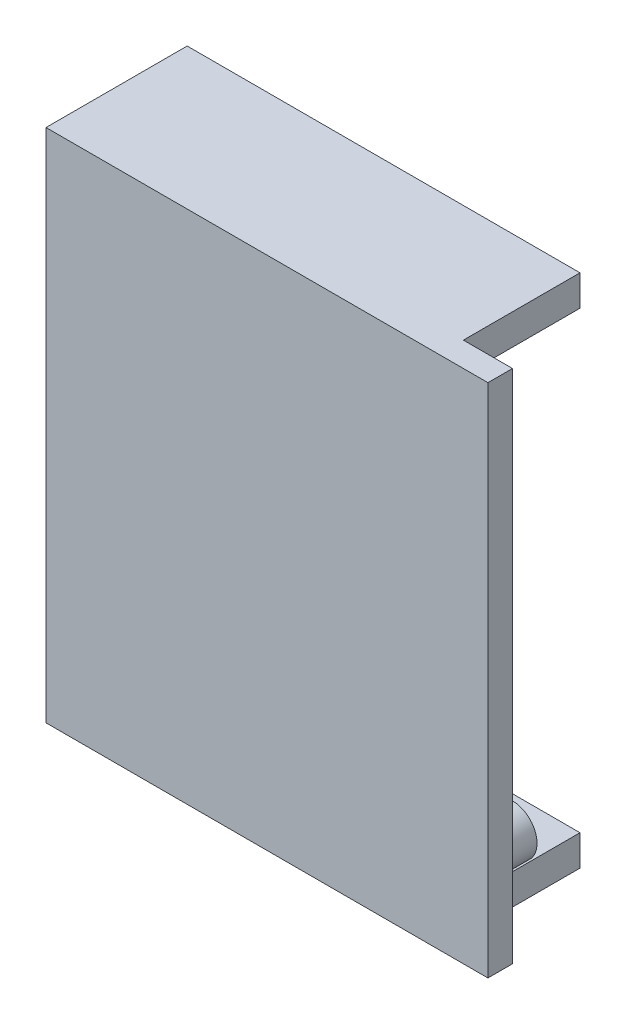
ISO-10303-21;
HEADER;
FILE_DESCRIPTION(('STEP AP214'),'2;1');
FILE_NAME('part.step','',(''),(''),'','','');
FILE_SCHEMA(('AUTOMOTIVE_DESIGN { 1 0 10303 214 1 1 1 1 }'));
ENDSEC;
DATA;
#1=APPLICATION_CONTEXT('core data for automotive mechanical design processes');
#2=APPLICATION_PROTOCOL_DEFINITION('international standard','automotive_design',2000,#1);
#3=PRODUCT_CONTEXT('',#1,'mechanical');
#4=PRODUCT('Part','Part','',(#3));
#5=PRODUCT_RELATED_PRODUCT_CATEGORY('part','',(#4));
#6=PRODUCT_DEFINITION_FORMATION('','',#4);
#7=PRODUCT_DEFINITION_CONTEXT('part definition',#1,'design');
#8=PRODUCT_DEFINITION('design','',#6,#7);
#9=PRODUCT_DEFINITION_SHAPE('','',#8);
#10=(LENGTH_UNIT() NAMED_UNIT(*) SI_UNIT(.MILLI.,.METRE.));
#11=(NAMED_UNIT(*) PLANE_ANGLE_UNIT() SI_UNIT($,.RADIAN.));
#12=(NAMED_UNIT(*) SI_UNIT($,.STERADIAN.) SOLID_ANGLE_UNIT());
#13=UNCERTAINTY_MEASURE_WITH_UNIT(LENGTH_MEASURE(1.E-05),#10,'distance_accuracy_value','');
#14=(GEOMETRIC_REPRESENTATION_CONTEXT(3) GLOBAL_UNCERTAINTY_ASSIGNED_CONTEXT((#13)) GLOBAL_UNIT_ASSIGNED_CONTEXT((#10,
#11,#12)) REPRESENTATION_CONTEXT('',''));
#15=CARTESIAN_POINT('',(0.,0.,0.));
#16=DIRECTION('',(0.,0.,1.));
#17=DIRECTION('',(1.,0.,0.));
#18=AXIS2_PLACEMENT_3D('',#15,#16,#17);
#19=CARTESIAN_POINT('',(-21.,18.5,-9.5));
#20=DIRECTION('',(0.,1.,0.));
#21=DIRECTION('',(-1.,0.,0.));
#22=AXIS2_PLACEMENT_3D('',#19,#20,#21);
#23=PLANE('',#22);
#24=DIRECTION('',(0.,0.,-1.));
#25=VECTOR('',#24,1.);
#26=CARTESIAN_POINT('',(-17.,18.5,-9.5));
#27=LINE('',#26,#25);
#28=CARTESIAN_POINT('',(-17.,18.5,0.));
#29=VERTEX_POINT('',#28);
#30=CARTESIAN_POINT('',(-17.,18.5,-9.5));
#31=VERTEX_POINT('',#30);
#32=EDGE_CURVE('E221',#29,#31,#27,.T.);
#33=ORIENTED_EDGE('',*,*,#32,.T.);
#34=DIRECTION('',(-1.,0.,0.));
#35=VECTOR('',#34,1.);
#36=CARTESIAN_POINT('',(-21.,18.5,-9.5));
#37=LINE('',#36,#35);
#38=CARTESIAN_POINT('',(11.,18.5,-9.5));
#39=VERTEX_POINT('',#38);
#40=EDGE_CURVE('E233',#39,#31,#37,.T.);
#41=ORIENTED_EDGE('',*,*,#40,.F.);
#42=DIRECTION('',(0.,0.,1.));
#43=VECTOR('',#42,1.);
#44=CARTESIAN_POINT('',(11.,18.5,-9.5));
#45=LINE('',#44,#43);
#46=CARTESIAN_POINT('',(11.,18.5,0.));
#47=VERTEX_POINT('',#46);
#48=EDGE_CURVE('E394',#39,#47,#45,.T.);
#49=ORIENTED_EDGE('',*,*,#48,.T.);
#50=DIRECTION('',(-1.,0.,0.));
#51=VECTOR('',#50,1.);
#52=CARTESIAN_POINT('',(-21.,18.5,0.));
#53=LINE('',#52,#51);
#54=CARTESIAN_POINT('',(-8.99999999999999,18.5,0.));
#55=VERTEX_POINT('',#54);
#56=EDGE_CURVE('E389',#47,#55,#53,.T.);
#57=ORIENTED_EDGE('',*,*,#56,.T.);
#58=DIRECTION('',(0.,0.,1.));
#59=VECTOR('',#58,1.);
#60=CARTESIAN_POINT('',(-8.99999999999999,18.5,-9.));
#61=LINE('',#60,#59);
#62=CARTESIAN_POINT('',(-8.99999999999999,18.5,-4.));
#63=VERTEX_POINT('',#62);
#64=EDGE_CURVE('E288',#63,#55,#61,.T.);
#65=ORIENTED_EDGE('',*,*,#64,.F.);
#66=DIRECTION('',(1.,0.,0.));
#67=VECTOR('',#66,1.);
#68=CARTESIAN_POINT('',(-8.99999999999999,18.5,-4.));
#69=LINE('',#68,#67);
#70=CARTESIAN_POINT('',(-13.,18.5,-4.));
#71=VERTEX_POINT('',#70);
#72=EDGE_CURVE('E293',#71,#63,#69,.T.);
#73=ORIENTED_EDGE('',*,*,#72,.F.);
#74=DIRECTION('',(0.,0.,1.));
#75=VECTOR('',#74,1.);
#76=CARTESIAN_POINT('',(-13.,18.5,-9.));
#77=LINE('',#76,#75);
#78=CARTESIAN_POINT('',(-13.,18.5,0.));
#79=VERTEX_POINT('',#78);
#80=EDGE_CURVE('E291',#71,#79,#77,.T.);
#81=ORIENTED_EDGE('',*,*,#80,.T.);
#82=EDGE_CURVE('E397',#79,#29,#53,.T.);
#83=ORIENTED_EDGE('',*,*,#82,.T.);
#84=EDGE_LOOP('',(#33,#41,#49,#57,#65,#73,#81,#83));
#85=FACE_BOUND('',#84,.T.);
#86=ADVANCED_FACE('F35',(#85),#23,.F.);
#87=CARTESIAN_POINT('',(0.,0.,0.));
#88=DIRECTION('',(0.,0.,-1.));
#89=DIRECTION('',(-1.,0.,0.));
#90=AXIS2_PLACEMENT_3D('',#87,#88,#89);
#91=PLANE('',#90);
#92=DIRECTION('',(-1.,0.,0.));
#93=VECTOR('',#92,1.);
#94=CARTESIAN_POINT('',(-17.,17.,0.));
#95=LINE('',#94,#93);
#96=CARTESIAN_POINT('',(-17.,17.,0.));
#97=VERTEX_POINT('',#96);
#98=CARTESIAN_POINT('',(-21.,17.,0.));
#99=VERTEX_POINT('',#98);
#100=EDGE_CURVE('E220',#97,#99,#95,.T.);
#101=ORIENTED_EDGE('',*,*,#100,.F.);
#102=DIRECTION('',(0.,1.,0.));
#103=VECTOR('',#102,1.);
#104=CARTESIAN_POINT('',(-17.,18.5,0.));
#105=LINE('',#104,#103);
#106=EDGE_CURVE('E228',#97,#29,#105,.T.);
#107=ORIENTED_EDGE('',*,*,#106,.T.);
#108=ORIENTED_EDGE('',*,*,#82,.F.);
#109=DIRECTION('',(0.,1.,0.));
#110=VECTOR('',#109,1.);
#111=CARTESIAN_POINT('',(-13.,18.5,0.));
#112=LINE('',#111,#110);
#113=CARTESIAN_POINT('',(-13.,15.5,0.));
#114=VERTEX_POINT('',#113);
#115=EDGE_CURVE('E289',#114,#79,#112,.T.);
#116=ORIENTED_EDGE('',*,*,#115,.F.);
#117=CARTESIAN_POINT('',(-11.,15.5,0.));
#118=DIRECTION('',(0.,0.,-1.));
#119=DIRECTION('',(-1.,0.,0.));
#120=AXIS2_PLACEMENT_3D('',#117,#118,#119);
#121=CIRCLE('',#120,2.);
#122=CARTESIAN_POINT('',(-8.99999999999999,15.5,0.));
#123=VERTEX_POINT('',#122);
#124=EDGE_CURVE('E328',#123,#114,#121,.T.);
#125=ORIENTED_EDGE('',*,*,#124,.F.);
#126=DIRECTION('',(0.,-1.,0.));
#127=VECTOR('',#126,1.);
#128=CARTESIAN_POINT('',(-8.99999999999999,15.5,0.));
#129=LINE('',#128,#127);
#130=EDGE_CURVE('E285',#55,#123,#129,.T.);
#131=ORIENTED_EDGE('',*,*,#130,.F.);
#132=ORIENTED_EDGE('',*,*,#56,.F.);
#133=DIRECTION('',(0.,1.,0.));
#134=VECTOR('',#133,1.);
#135=CARTESIAN_POINT('',(11.,19.75,0.));
#136=LINE('',#135,#134);
#137=CARTESIAN_POINT('',(11.,-13.5,0.));
#138=VERTEX_POINT('',#137);
#139=EDGE_CURVE('E354',#138,#47,#136,.T.);
#140=ORIENTED_EDGE('',*,*,#139,.F.);
#141=CARTESIAN_POINT('',(11.,-15.5,0.));
#142=DIRECTION('',(0.,0.,-1.));
#143=DIRECTION('',(-1.,0.,0.));
#144=AXIS2_PLACEMENT_3D('',#141,#142,#143);
#145=CIRCLE('',#144,2.);
#146=CARTESIAN_POINT('',(9.00000000000001,-15.5,0.));
#147=VERTEX_POINT('',#146);
#148=EDGE_CURVE('E319',#147,#138,#145,.T.);
#149=ORIENTED_EDGE('',*,*,#148,.F.);
#150=DIRECTION('',(0.,1.,0.));
#151=VECTOR('',#150,1.);
#152=CARTESIAN_POINT('',(9.00000000000001,-15.5,0.));
#153=LINE('',#152,#151);
#154=CARTESIAN_POINT('',(9.00000000000001,-18.5,0.));
#155=VERTEX_POINT('',#154);
#156=EDGE_CURVE('E272',#155,#147,#153,.T.);
#157=ORIENTED_EDGE('',*,*,#156,.F.);
#158=DIRECTION('',(1.,0.,0.));
#159=VECTOR('',#158,1.);
#160=CARTESIAN_POINT('',(-21.,-18.5,0.));
#161=LINE('',#160,#159);
#162=CARTESIAN_POINT('',(-17.,-18.5,0.));
#163=VERTEX_POINT('',#162);
#164=EDGE_CURVE('E360',#163,#155,#161,.T.);
#165=ORIENTED_EDGE('',*,*,#164,.F.);
#166=DIRECTION('',(0.,1.,0.));
#167=VECTOR('',#166,1.);
#168=CARTESIAN_POINT('',(-17.,-18.5,0.));
#169=LINE('',#168,#167);
#170=CARTESIAN_POINT('',(-17.,-17.,0.));
#171=VERTEX_POINT('',#170);
#172=EDGE_CURVE('E245',#163,#171,#169,.T.);
#173=ORIENTED_EDGE('',*,*,#172,.T.);
#174=DIRECTION('',(-1.,0.,0.));
#175=VECTOR('',#174,1.);
#176=CARTESIAN_POINT('',(-17.,-17.,0.));
#177=LINE('',#176,#175);
#178=CARTESIAN_POINT('',(-21.,-17.,0.));
#179=VERTEX_POINT('',#178);
#180=EDGE_CURVE('E251',#171,#179,#177,.T.);
#181=ORIENTED_EDGE('',*,*,#180,.T.);
#182=DIRECTION('',(0.,-1.,0.));
#183=VECTOR('',#182,1.);
#184=CARTESIAN_POINT('',(-21.,-21.,0.));
#185=LINE('',#184,#183);
#186=EDGE_CURVE('E405',#99,#179,#185,.T.);
#187=ORIENTED_EDGE('',*,*,#186,.F.);
#188=EDGE_LOOP('',(#101,#107,#108,#116,#125,#131,#132,#140,#149,#157,#165,#173,#181,#187));
#189=FACE_BOUND('',#188,.T.);
#190=CARTESIAN_POINT('',(7.5,12.5,0.));
#191=DIRECTION('',(0.,0.,-1.));
#192=DIRECTION('',(-1.,0.,0.));
#193=AXIS2_PLACEMENT_3D('',#190,#191,#192);
#194=CIRCLE('',#193,2.5);
#195=CARTESIAN_POINT('',(5.,12.5,0.));
#196=VERTEX_POINT('',#195);
#197=EDGE_CURVE('E257',#196,#196,#194,.T.);
#198=ORIENTED_EDGE('',*,*,#197,.F.);
#199=EDGE_LOOP('',(#198));
#200=FACE_BOUND('',#199,.T.);
#201=CARTESIAN_POINT('',(-7.5,-12.5,0.));
#202=DIRECTION('',(0.,0.,-1.));
#203=DIRECTION('',(-1.,0.,0.));
#204=AXIS2_PLACEMENT_3D('',#201,#202,#203);
#205=CIRCLE('',#204,2.5);
#206=CARTESIAN_POINT('',(-10.,-12.5,0.));
#207=VERTEX_POINT('',#206);
#208=EDGE_CURVE('E263',#207,#207,#205,.T.);
#209=ORIENTED_EDGE('',*,*,#208,.F.);
#210=EDGE_LOOP('',(#209));
#211=FACE_BOUND('',#210,.T.);
#212=ADVANCED_FACE('F447',(#189,#200,#211),#91,.T.);
#213=CARTESIAN_POINT('',(-21.,-18.5,-9.5));
#214=DIRECTION('',(0.,-1.,0.));
#215=DIRECTION('',(1.,0.,0.));
#216=AXIS2_PLACEMENT_3D('',#213,#214,#215);
#217=PLANE('',#216);
#218=DIRECTION('',(1.,0.,0.));
#219=VECTOR('',#218,1.);
#220=CARTESIAN_POINT('',(-21.,-18.5,-9.5));
#221=LINE('',#220,#219);
#222=CARTESIAN_POINT('',(-17.,-18.5,-9.5));
#223=VERTEX_POINT('',#222);
#224=CARTESIAN_POINT('',(11.,-18.5,-9.5));
#225=VERTEX_POINT('',#224);
#226=EDGE_CURVE('E369',#223,#225,#221,.T.);
#227=ORIENTED_EDGE('',*,*,#226,.F.);
#228=DIRECTION('',(0.,0.,1.));
#229=VECTOR('',#228,1.);
#230=CARTESIAN_POINT('',(-17.,-18.5,-9.5));
#231=LINE('',#230,#229);
#232=EDGE_CURVE('E242',#223,#163,#231,.T.);
#233=ORIENTED_EDGE('',*,*,#232,.T.);
#234=ORIENTED_EDGE('',*,*,#164,.T.);
#235=DIRECTION('',(0.,0.,1.));
#236=VECTOR('',#235,1.);
#237=CARTESIAN_POINT('',(9.00000000000001,-18.5,-7.605551275464));
#238=LINE('',#237,#236);
#239=CARTESIAN_POINT('',(9.00000000000001,-18.5,-4.));
#240=VERTEX_POINT('',#239);
#241=EDGE_CURVE('E274',#240,#155,#238,.T.);
#242=ORIENTED_EDGE('',*,*,#241,.F.);
#243=DIRECTION('',(-1.,0.,0.));
#244=VECTOR('',#243,1.);
#245=CARTESIAN_POINT('',(9.00000000000001,-18.5,-4.));
#246=LINE('',#245,#244);
#247=CARTESIAN_POINT('',(11.,-18.5,-4.));
#248=VERTEX_POINT('',#247);
#249=EDGE_CURVE('E275',#248,#240,#246,.T.);
#250=ORIENTED_EDGE('',*,*,#249,.F.);
#251=DIRECTION('',(0.,0.,1.));
#252=VECTOR('',#251,1.);
#253=CARTESIAN_POINT('',(11.,-18.5,-9.5));
#254=LINE('',#253,#252);
#255=EDGE_CURVE('E382',#225,#248,#254,.T.);
#256=ORIENTED_EDGE('',*,*,#255,.F.);
#257=EDGE_LOOP('',(#227,#233,#234,#242,#250,#256));
#258=FACE_BOUND('',#257,.T.);
#259=ADVANCED_FACE('F455',(#258),#217,.F.);
#260=CARTESIAN_POINT('',(11.,-15.5,-4.));
#261=DIRECTION('',(0.,0.,1.));
#262=DIRECTION('',(1.,0.,0.));
#263=AXIS2_PLACEMENT_3D('',#260,#261,#262);
#264=CYLINDRICAL_SURFACE('',#263,2.);
#265=DIRECTION('',(0.,0.,-1.));
#266=VECTOR('',#265,1.);
#267=CARTESIAN_POINT('',(11.,-17.5,6.65685424949238));
#268=LINE('',#267,#266);
#269=CARTESIAN_POINT('',(11.,-17.5,-4.));
#270=VERTEX_POINT('',#269);
#271=CARTESIAN_POINT('',(11.,-17.5,1.));
#272=VERTEX_POINT('',#271);
#273=EDGE_CURVE('E309',#270,#272,#268,.F.);
#274=ORIENTED_EDGE('',*,*,#273,.F.);
#275=CARTESIAN_POINT('',(11.,-15.5,-4.));
#276=DIRECTION('',(0.,0.,-1.));
#277=DIRECTION('',(-1.,0.,0.));
#278=AXIS2_PLACEMENT_3D('',#275,#276,#277);
#279=CIRCLE('',#278,2.);
#280=CARTESIAN_POINT('',(9.00000000000001,-15.5,-4.));
#281=VERTEX_POINT('',#280);
#282=EDGE_CURVE('E322',#281,#270,#279,.T.);
#283=ORIENTED_EDGE('',*,*,#282,.F.);
#284=DIRECTION('',(0.,0.,1.));
#285=VECTOR('',#284,1.);
#286=CARTESIAN_POINT('',(9.00000000000001,-15.5,-7.605551275464));
#287=LINE('',#286,#285);
#288=EDGE_CURVE('E269',#281,#147,#287,.T.);
#289=ORIENTED_EDGE('',*,*,#288,.T.);
#290=ORIENTED_EDGE('',*,*,#148,.T.);
#291=DIRECTION('',(0.,0.,-1.));
#292=VECTOR('',#291,1.);
#293=CARTESIAN_POINT('',(11.,-13.5,6.65685424949238));
#294=LINE('',#293,#292);
#295=CARTESIAN_POINT('',(11.,-13.5,1.));
#296=VERTEX_POINT('',#295);
#297=EDGE_CURVE('E312',#296,#138,#294,.T.);
#298=ORIENTED_EDGE('',*,*,#297,.F.);
#299=CARTESIAN_POINT('',(11.,-15.5,1.));
#300=DIRECTION('',(0.,0.,-1.));
#301=DIRECTION('',(-1.,0.,0.));
#302=AXIS2_PLACEMENT_3D('',#299,#300,#301);
#303=CIRCLE('',#302,2.);
#304=EDGE_CURVE('E296',#272,#296,#303,.F.);
#305=ORIENTED_EDGE('',*,*,#304,.F.);
#306=EDGE_LOOP('',(#274,#283,#289,#290,#298,#305));
#307=FACE_BOUND('',#306,.T.);
#308=ADVANCED_FACE('F695',(#307),#264,.T.);
#309=CARTESIAN_POINT('',(-11.,15.5,-4.));
#310=DIRECTION('',(0.,0.,1.));
#311=DIRECTION('',(1.,0.,0.));
#312=AXIS2_PLACEMENT_3D('',#309,#310,#311);
#313=CYLINDRICAL_SURFACE('',#312,2.);
#314=DIRECTION('',(0.,0.,1.));
#315=VECTOR('',#314,1.);
#316=CARTESIAN_POINT('',(-13.,15.5,-9.));
#317=LINE('',#316,#315);
#318=CARTESIAN_POINT('',(-13.,15.5,-4.));
#319=VERTEX_POINT('',#318);
#320=EDGE_CURVE('E292',#319,#114,#317,.T.);
#321=ORIENTED_EDGE('',*,*,#320,.F.);
#322=CARTESIAN_POINT('',(-11.,15.5,-4.));
#323=DIRECTION('',(0.,0.,-1.));
#324=DIRECTION('',(-1.,0.,0.));
#325=AXIS2_PLACEMENT_3D('',#322,#323,#324);
#326=CIRCLE('',#325,2.);
#327=CARTESIAN_POINT('',(-8.99999999999999,15.5,-4.));
#328=VERTEX_POINT('',#327);
#329=EDGE_CURVE('E329',#328,#319,#326,.T.);
#330=ORIENTED_EDGE('',*,*,#329,.F.);
#331=DIRECTION('',(0.,0.,1.));
#332=VECTOR('',#331,1.);
#333=CARTESIAN_POINT('',(-8.99999999999999,15.5,-9.));
#334=LINE('',#333,#332);
#335=EDGE_CURVE('E277',#328,#123,#334,.T.);
#336=ORIENTED_EDGE('',*,*,#335,.T.);
#337=ORIENTED_EDGE('',*,*,#124,.T.);
#338=EDGE_LOOP('',(#321,#330,#336,#337));
#339=FACE_BOUND('',#338,.T.);
#340=ADVANCED_FACE('F498',(#339),#313,.T.);
#341=CARTESIAN_POINT('',(11.,21.,-9.5));
#342=DIRECTION('',(-1.,0.,0.));
#343=DIRECTION('',(0.,0.,1.));
#344=AXIS2_PLACEMENT_3D('',#341,#342,#343);
#345=PLANE('',#344);
#346=DIRECTION('',(0.,1.,0.));
#347=VECTOR('',#346,1.);
#348=CARTESIAN_POINT('',(11.,19.75,1.));
#349=LINE('',#348,#347);
#350=CARTESIAN_POINT('',(11.,19.75,1.));
#351=VERTEX_POINT('',#350);
#352=EDGE_CURVE('E342',#296,#351,#349,.T.);
#353=ORIENTED_EDGE('',*,*,#352,.F.);
#354=ORIENTED_EDGE('',*,*,#297,.T.);
#355=ORIENTED_EDGE('',*,*,#139,.T.);
#356=ORIENTED_EDGE('',*,*,#48,.F.);
#357=DIRECTION('',(0.,-1.,0.));
#358=VECTOR('',#357,1.);
#359=CARTESIAN_POINT('',(11.,21.,-9.5));
#360=LINE('',#359,#358);
#361=CARTESIAN_POINT('',(11.,21.,-9.5));
#362=VERTEX_POINT('',#361);
#363=EDGE_CURVE('E391',#362,#39,#360,.T.);
#364=ORIENTED_EDGE('',*,*,#363,.F.);
#365=DIRECTION('',(0.,0.,1.));
#366=VECTOR('',#365,1.);
#367=CARTESIAN_POINT('',(11.,21.,-9.5));
#368=LINE('',#367,#366);
#369=CARTESIAN_POINT('',(11.,21.,0.));
#370=VERTEX_POINT('',#369);
#371=EDGE_CURVE('E402',#362,#370,#368,.T.);
#372=ORIENTED_EDGE('',*,*,#371,.T.);
#373=DIRECTION('',(0.,-1.,0.));
#374=VECTOR('',#373,1.);
#375=CARTESIAN_POINT('',(11.,21.,0.));
#376=LINE('',#375,#374);
#377=CARTESIAN_POINT('',(11.,19.75,0.));
#378=VERTEX_POINT('',#377);
#379=EDGE_CURVE('E385',#370,#378,#376,.T.);
#380=ORIENTED_EDGE('',*,*,#379,.T.);
#381=DIRECTION('',(0.,0.,-1.));
#382=VECTOR('',#381,1.);
#383=CARTESIAN_POINT('',(11.,19.75,1.));
#384=LINE('',#383,#382);
#385=EDGE_CURVE('E361',#351,#378,#384,.T.);
#386=ORIENTED_EDGE('',*,*,#385,.F.);
#387=EDGE_LOOP('',(#353,#354,#355,#356,#364,#372,#380,#386));
#388=FACE_BOUND('',#387,.T.);
#389=ADVANCED_FACE('F486',(#388),#345,.F.);
#390=CARTESIAN_POINT('',(11.,-15.5,0.));
#391=DIRECTION('',(0.,0.,-1.));
#392=DIRECTION('',(-1.,0.,0.));
#393=AXIS2_PLACEMENT_3D('',#390,#391,#392);
#394=CIRCLE('',#393,1.1);
#395=CARTESIAN_POINT('',(9.90000000000001,-15.5,0.));
#396=VERTEX_POINT('',#395);
#397=EDGE_CURVE('E315',#396,#396,#394,.T.);
#398=ORIENTED_EDGE('',*,*,#397,.T.);
#399=EDGE_LOOP('',(#398));
#400=FACE_BOUND('',#399,.T.);
#401=ADVANCED_FACE('F528',(#400),#91,.T.);
#402=DIRECTION('',(1.,0.,0.));
#403=VECTOR('',#402,1.);
#404=CARTESIAN_POINT('',(14.,19.75,0.));
#405=LINE('',#404,#403);
#406=CARTESIAN_POINT('',(14.,19.75,0.));
#407=VERTEX_POINT('',#406);
#408=EDGE_CURVE('E339',#378,#407,#405,.T.);
#409=ORIENTED_EDGE('',*,*,#408,.F.);
#410=ORIENTED_EDGE('',*,*,#379,.F.);
#411=DIRECTION('',(-1.,0.,0.));
#412=VECTOR('',#411,1.);
#413=CARTESIAN_POINT('',(-21.,21.,0.));
#414=LINE('',#413,#412);
#415=CARTESIAN_POINT('',(15.,21.,0.));
#416=VERTEX_POINT('',#415);
#417=EDGE_CURVE('E410',#416,#370,#414,.T.);
#418=ORIENTED_EDGE('',*,*,#417,.F.);
#419=DIRECTION('',(0.,1.,0.));
#420=VECTOR('',#419,1.);
#421=CARTESIAN_POINT('',(15.,-21.,0.));
#422=LINE('',#421,#420);
#423=CARTESIAN_POINT('',(15.,-21.,0.));
#424=VERTEX_POINT('',#423);
#425=EDGE_CURVE('E420',#424,#416,#422,.T.);
#426=ORIENTED_EDGE('',*,*,#425,.F.);
#427=DIRECTION('',(1.,0.,0.));
#428=VECTOR('',#427,1.);
#429=CARTESIAN_POINT('',(-21.,-21.,0.));
#430=LINE('',#429,#428);
#431=CARTESIAN_POINT('',(11.,-21.,0.));
#432=VERTEX_POINT('',#431);
#433=EDGE_CURVE('E418',#432,#424,#430,.T.);
#434=ORIENTED_EDGE('',*,*,#433,.F.);
#435=DIRECTION('',(0.,-1.,0.));
#436=VECTOR('',#435,1.);
#437=CARTESIAN_POINT('',(11.,-21.,0.));
#438=LINE('',#437,#436);
#439=CARTESIAN_POINT('',(11.,-19.75,0.));
#440=VERTEX_POINT('',#439);
#441=EDGE_CURVE('E370',#440,#432,#438,.T.);
#442=ORIENTED_EDGE('',*,*,#441,.F.);
#443=DIRECTION('',(-1.,0.,0.));
#444=VECTOR('',#443,1.);
#445=CARTESIAN_POINT('',(14.,-19.75,0.));
#446=LINE('',#445,#444);
#447=CARTESIAN_POINT('',(14.,-19.75,0.));
#448=VERTEX_POINT('',#447);
#449=EDGE_CURVE('E352',#448,#440,#446,.T.);
#450=ORIENTED_EDGE('',*,*,#449,.F.);
#451=DIRECTION('',(0.,-1.,0.));
#452=VECTOR('',#451,1.);
#453=CARTESIAN_POINT('',(14.,19.75,0.));
#454=LINE('',#453,#452);
#455=EDGE_CURVE('E332',#407,#448,#454,.T.);
#456=ORIENTED_EDGE('',*,*,#455,.F.);
#457=EDGE_LOOP('',(#409,#410,#418,#426,#434,#442,#450,#456));
#458=FACE_BOUND('',#457,.T.);
#459=ADVANCED_FACE('F467',(#458),#91,.T.);
#460=CARTESIAN_POINT('',(-21.,-21.,2.));
#461=DIRECTION('',(1.,0.,0.));
#462=DIRECTION('',(0.,0.,-1.));
#463=AXIS2_PLACEMENT_3D('',#460,#461,#462);
#464=PLANE('',#463);
#465=DIRECTION('',(0.,1.,0.));
#466=VECTOR('',#465,1.);
#467=CARTESIAN_POINT('',(-21.,21.,-9.5));
#468=LINE('',#467,#466);
#469=CARTESIAN_POINT('',(-21.,17.,-9.5));
#470=VERTEX_POINT('',#469);
#471=CARTESIAN_POINT('',(-21.,21.,-9.5));
#472=VERTEX_POINT('',#471);
#473=EDGE_CURVE('E386',#470,#472,#468,.T.);
#474=ORIENTED_EDGE('',*,*,#473,.F.);
#475=DIRECTION('',(0.,0.,1.));
#476=VECTOR('',#475,1.);
#477=CARTESIAN_POINT('',(-21.,17.,-9.5));
#478=LINE('',#477,#476);
#479=EDGE_CURVE('E216',#470,#99,#478,.T.);
#480=ORIENTED_EDGE('',*,*,#479,.T.);
#481=ORIENTED_EDGE('',*,*,#186,.T.);
#482=DIRECTION('',(0.,0.,-1.));
#483=VECTOR('',#482,1.);
#484=CARTESIAN_POINT('',(-21.,-17.,-9.5));
#485=LINE('',#484,#483);
#486=CARTESIAN_POINT('',(-21.,-17.,-9.5));
#487=VERTEX_POINT('',#486);
#488=EDGE_CURVE('E239',#179,#487,#485,.T.);
#489=ORIENTED_EDGE('',*,*,#488,.T.);
#490=DIRECTION('',(0.,1.,0.));
#491=VECTOR('',#490,1.);
#492=CARTESIAN_POINT('',(-21.,-21.,-9.5));
#493=LINE('',#492,#491);
#494=CARTESIAN_POINT('',(-21.,-21.,-9.5));
#495=VERTEX_POINT('',#494);
#496=EDGE_CURVE('E367',#495,#487,#493,.T.);
#497=ORIENTED_EDGE('',*,*,#496,.F.);
#498=DIRECTION('',(0.,0.,-1.));
#499=VECTOR('',#498,1.);
#500=CARTESIAN_POINT('',(-21.,-21.,2.));
#501=LINE('',#500,#499);
#502=CARTESIAN_POINT('',(-21.,-21.,2.));
#503=VERTEX_POINT('',#502);
#504=EDGE_CURVE('E43',#503,#495,#501,.T.);
#505=ORIENTED_EDGE('',*,*,#504,.F.);
#506=DIRECTION('',(0.,-1.,0.));
#507=VECTOR('',#506,1.);
#508=CARTESIAN_POINT('',(-21.,-21.,2.));
#509=LINE('',#508,#507);
#510=CARTESIAN_POINT('',(-21.,21.,2.));
#511=VERTEX_POINT('',#510);
#512=EDGE_CURVE('E406',#511,#503,#509,.T.);
#513=ORIENTED_EDGE('',*,*,#512,.F.);
#514=DIRECTION('',(0.,0.,-1.));
#515=VECTOR('',#514,1.);
#516=CARTESIAN_POINT('',(-21.,21.,2.));
#517=LINE('',#516,#515);
#518=EDGE_CURVE('E416',#511,#472,#517,.T.);
#519=ORIENTED_EDGE('',*,*,#518,.T.);
#520=EDGE_LOOP('',(#474,#480,#481,#489,#497,#505,#513,#519));
#521=FACE_BOUND('',#520,.T.);
#522=ADVANCED_FACE('F37',(#521),#464,.F.);
#523=CARTESIAN_POINT('',(-21.,-21.,2.));
#524=DIRECTION('',(0.,1.,0.));
#525=DIRECTION('',(0.,0.,1.));
#526=AXIS2_PLACEMENT_3D('',#523,#524,#525);
#527=PLANE('',#526);
#528=ORIENTED_EDGE('',*,*,#504,.T.);
#529=DIRECTION('',(-1.,0.,0.));
#530=VECTOR('',#529,1.);
#531=CARTESIAN_POINT('',(-21.,-21.,-9.5));
#532=LINE('',#531,#530);
#533=CARTESIAN_POINT('',(11.,-21.,-9.5));
#534=VERTEX_POINT('',#533);
#535=EDGE_CURVE('E374',#534,#495,#532,.T.);
#536=ORIENTED_EDGE('',*,*,#535,.F.);
#537=DIRECTION('',(0.,0.,1.));
#538=VECTOR('',#537,1.);
#539=CARTESIAN_POINT('',(11.,-21.,-9.5));
#540=LINE('',#539,#538);
#541=EDGE_CURVE('E377',#534,#432,#540,.T.);
#542=ORIENTED_EDGE('',*,*,#541,.T.);
#543=ORIENTED_EDGE('',*,*,#433,.T.);
#544=DIRECTION('',(0.,0.,-1.));
#545=VECTOR('',#544,1.);
#546=CARTESIAN_POINT('',(15.,-21.,2.));
#547=LINE('',#546,#545);
#548=CARTESIAN_POINT('',(15.,-21.,2.));
#549=VERTEX_POINT('',#548);
#550=EDGE_CURVE('E428',#549,#424,#547,.T.);
#551=ORIENTED_EDGE('',*,*,#550,.F.);
#552=DIRECTION('',(1.,0.,0.));
#553=VECTOR('',#552,1.);
#554=CARTESIAN_POINT('',(-21.,-21.,2.));
#555=LINE('',#554,#553);
#556=EDGE_CURVE('E409',#503,#549,#555,.T.);
#557=ORIENTED_EDGE('',*,*,#556,.F.);
#558=EDGE_LOOP('',(#528,#536,#542,#543,#551,#557));
#559=FACE_BOUND('',#558,.T.);
#560=ADVANCED_FACE('F433',(#559),#527,.F.);
#561=CARTESIAN_POINT('',(15.,-21.,2.));
#562=DIRECTION('',(-1.,0.,0.));
#563=DIRECTION('',(0.,0.,1.));
#564=AXIS2_PLACEMENT_3D('',#561,#562,#563);
#565=PLANE('',#564);
#566=ORIENTED_EDGE('',*,*,#425,.T.);
#567=DIRECTION('',(0.,0.,-1.));
#568=VECTOR('',#567,1.);
#569=CARTESIAN_POINT('',(15.,21.,2.));
#570=LINE('',#569,#568);
#571=CARTESIAN_POINT('',(15.,21.,2.));
#572=VERTEX_POINT('',#571);
#573=EDGE_CURVE('E425',#572,#416,#570,.T.);
#574=ORIENTED_EDGE('',*,*,#573,.F.);
#575=DIRECTION('',(0.,1.,0.));
#576=VECTOR('',#575,1.);
#577=CARTESIAN_POINT('',(15.,-21.,2.));
#578=LINE('',#577,#576);
#579=EDGE_CURVE('E412',#549,#572,#578,.T.);
#580=ORIENTED_EDGE('',*,*,#579,.F.);
#581=ORIENTED_EDGE('',*,*,#550,.T.);
#582=EDGE_LOOP('',(#566,#574,#580,#581));
#583=FACE_BOUND('',#582,.T.);
#584=ADVANCED_FACE('F472',(#583),#565,.F.);
#585=CARTESIAN_POINT('',(-21.,21.,2.));
#586=DIRECTION('',(0.,-1.,0.));
#587=DIRECTION('',(0.,0.,-1.));
#588=AXIS2_PLACEMENT_3D('',#585,#586,#587);
#589=PLANE('',#588);
#590=ORIENTED_EDGE('',*,*,#417,.T.);
#591=ORIENTED_EDGE('',*,*,#371,.F.);
#592=DIRECTION('',(1.,0.,0.));
#593=VECTOR('',#592,1.);
#594=CARTESIAN_POINT('',(-21.,21.,-9.5));
#595=LINE('',#594,#593);
#596=EDGE_CURVE('E388',#472,#362,#595,.T.);
#597=ORIENTED_EDGE('',*,*,#596,.F.);
#598=ORIENTED_EDGE('',*,*,#518,.F.);
#599=DIRECTION('',(-1.,0.,0.));
#600=VECTOR('',#599,1.);
#601=CARTESIAN_POINT('',(-21.,21.,2.));
#602=LINE('',#601,#600);
#603=EDGE_CURVE('E414',#572,#511,#602,.T.);
#604=ORIENTED_EDGE('',*,*,#603,.F.);
#605=ORIENTED_EDGE('',*,*,#573,.T.);
#606=EDGE_LOOP('',(#590,#591,#597,#598,#604,#605));
#607=FACE_BOUND('',#606,.T.);
#608=ADVANCED_FACE('F476',(#607),#589,.F.);
#609=CARTESIAN_POINT('',(0.,0.,2.));
#610=DIRECTION('',(0.,0.,-1.));
#611=DIRECTION('',(-1.,0.,0.));
#612=AXIS2_PLACEMENT_3D('',#609,#610,#611);
#613=PLANE('',#612);
#614=ORIENTED_EDGE('',*,*,#512,.T.);
#615=ORIENTED_EDGE('',*,*,#556,.T.);
#616=ORIENTED_EDGE('',*,*,#579,.T.);
#617=ORIENTED_EDGE('',*,*,#603,.T.);
#618=EDGE_LOOP('',(#614,#615,#616,#617));
#619=FACE_BOUND('',#618,.T.);
#620=ADVANCED_FACE('F481',(#619),#613,.F.);
#621=DIRECTION('',(0.,-1.,0.));
#622=VECTOR('',#621,1.);
#623=CARTESIAN_POINT('',(11.,-17.5,-4.));
#624=LINE('',#623,#622);
#625=EDGE_CURVE('E278',#270,#248,#624,.T.);
#626=ORIENTED_EDGE('',*,*,#625,.F.);
#627=ORIENTED_EDGE('',*,*,#273,.T.);
#628=CARTESIAN_POINT('',(11.,-19.75,1.));
#629=VERTEX_POINT('',#628);
#630=EDGE_CURVE('E343',#629,#272,#349,.T.);
#631=ORIENTED_EDGE('',*,*,#630,.F.);
#632=DIRECTION('',(0.,0.,-1.));
#633=VECTOR('',#632,1.);
#634=CARTESIAN_POINT('',(11.,-19.75,1.));
#635=LINE('',#634,#633);
#636=EDGE_CURVE('E363',#629,#440,#635,.T.);
#637=ORIENTED_EDGE('',*,*,#636,.T.);
#638=ORIENTED_EDGE('',*,*,#441,.T.);
#639=ORIENTED_EDGE('',*,*,#541,.F.);
#640=DIRECTION('',(0.,-1.,0.));
#641=VECTOR('',#640,1.);
#642=CARTESIAN_POINT('',(11.,-21.,-9.5));
#643=LINE('',#642,#641);
#644=EDGE_CURVE('E372',#225,#534,#643,.T.);
#645=ORIENTED_EDGE('',*,*,#644,.F.);
#646=ORIENTED_EDGE('',*,*,#255,.T.);
#647=EDGE_LOOP('',(#626,#627,#631,#637,#638,#639,#645,#646));
#648=FACE_BOUND('',#647,.T.);
#649=ADVANCED_FACE('F461',(#648),#345,.F.);
#650=CARTESIAN_POINT('',(0.,0.,-9.5));
#651=DIRECTION('',(0.,0.,1.));
#652=DIRECTION('',(1.,0.,0.));
#653=AXIS2_PLACEMENT_3D('',#650,#651,#652);
#654=PLANE('',#653);
#655=ORIENTED_EDGE('',*,*,#473,.T.);
#656=ORIENTED_EDGE('',*,*,#596,.T.);
#657=ORIENTED_EDGE('',*,*,#363,.T.);
#658=ORIENTED_EDGE('',*,*,#40,.T.);
#659=DIRECTION('',(0.,-1.,0.));
#660=VECTOR('',#659,1.);
#661=CARTESIAN_POINT('',(-17.,18.5,-9.5));
#662=LINE('',#661,#660);
#663=CARTESIAN_POINT('',(-17.,17.,-9.5));
#664=VERTEX_POINT('',#663);
#665=EDGE_CURVE('E225',#31,#664,#662,.T.);
#666=ORIENTED_EDGE('',*,*,#665,.T.);
#667=DIRECTION('',(-1.,0.,0.));
#668=VECTOR('',#667,1.);
#669=CARTESIAN_POINT('',(-17.,17.,-9.5));
#670=LINE('',#669,#668);
#671=EDGE_CURVE('E210',#664,#470,#670,.T.);
#672=ORIENTED_EDGE('',*,*,#671,.T.);
#673=EDGE_LOOP('',(#655,#656,#657,#658,#666,#672));
#674=FACE_BOUND('',#673,.T.);
#675=ADVANCED_FACE('F231',(#674),#654,.F.);
#676=CARTESIAN_POINT('',(0.,0.,-9.5));
#677=DIRECTION('',(0.,0.,-1.));
#678=DIRECTION('',(-1.,0.,0.));
#679=AXIS2_PLACEMENT_3D('',#676,#677,#678);
#680=PLANE('',#679);
#681=ORIENTED_EDGE('',*,*,#496,.T.);
#682=DIRECTION('',(-1.,0.,0.));
#683=VECTOR('',#682,1.);
#684=CARTESIAN_POINT('',(-17.,-17.,-9.5));
#685=LINE('',#684,#683);
#686=CARTESIAN_POINT('',(-17.,-17.,-9.5));
#687=VERTEX_POINT('',#686);
#688=EDGE_CURVE('E254',#687,#487,#685,.T.);
#689=ORIENTED_EDGE('',*,*,#688,.F.);
#690=DIRECTION('',(0.,-1.,0.));
#691=VECTOR('',#690,1.);
#692=CARTESIAN_POINT('',(-17.,-18.5,-9.5));
#693=LINE('',#692,#691);
#694=EDGE_CURVE('E50',#687,#223,#693,.T.);
#695=ORIENTED_EDGE('',*,*,#694,.T.);
#696=ORIENTED_EDGE('',*,*,#226,.T.);
#697=ORIENTED_EDGE('',*,*,#644,.T.);
#698=ORIENTED_EDGE('',*,*,#535,.T.);
#699=EDGE_LOOP('',(#681,#689,#695,#696,#697,#698));
#700=FACE_BOUND('',#699,.T.);
#701=ADVANCED_FACE('F438',(#700),#680,.T.);
#702=CARTESIAN_POINT('',(14.,19.75,1.));
#703=DIRECTION('',(1.,0.,0.));
#704=DIRECTION('',(0.,1.,0.));
#705=AXIS2_PLACEMENT_3D('',#702,#703,#704);
#706=PLANE('',#705);
#707=ORIENTED_EDGE('',*,*,#455,.T.);
#708=DIRECTION('',(0.,0.,-1.));
#709=VECTOR('',#708,1.);
#710=CARTESIAN_POINT('',(14.,-19.75,1.));
#711=LINE('',#710,#709);
#712=CARTESIAN_POINT('',(14.,-19.75,1.));
#713=VERTEX_POINT('',#712);
#714=EDGE_CURVE('E349',#713,#448,#711,.T.);
#715=ORIENTED_EDGE('',*,*,#714,.F.);
#716=DIRECTION('',(0.,-1.,0.));
#717=VECTOR('',#716,1.);
#718=CARTESIAN_POINT('',(14.,19.75,1.));
#719=LINE('',#718,#717);
#720=CARTESIAN_POINT('',(14.,19.75,1.));
#721=VERTEX_POINT('',#720);
#722=EDGE_CURVE('E335',#721,#713,#719,.T.);
#723=ORIENTED_EDGE('',*,*,#722,.F.);
#724=DIRECTION('',(0.,0.,-1.));
#725=VECTOR('',#724,1.);
#726=CARTESIAN_POINT('',(14.,19.75,1.));
#727=LINE('',#726,#725);
#728=EDGE_CURVE('E358',#721,#407,#727,.T.);
#729=ORIENTED_EDGE('',*,*,#728,.T.);
#730=EDGE_LOOP('',(#707,#715,#723,#729));
#731=FACE_BOUND('',#730,.T.);
#732=ADVANCED_FACE('F562',(#731),#706,.F.);
#733=CARTESIAN_POINT('',(14.,19.75,1.));
#734=DIRECTION('',(0.,1.,0.));
#735=DIRECTION('',(0.,0.,1.));
#736=AXIS2_PLACEMENT_3D('',#733,#734,#735);
#737=PLANE('',#736);
#738=ORIENTED_EDGE('',*,*,#408,.T.);
#739=ORIENTED_EDGE('',*,*,#728,.F.);
#740=DIRECTION('',(1.,0.,0.));
#741=VECTOR('',#740,1.);
#742=CARTESIAN_POINT('',(14.,19.75,1.));
#743=LINE('',#742,#741);
#744=EDGE_CURVE('E346',#351,#721,#743,.T.);
#745=ORIENTED_EDGE('',*,*,#744,.F.);
#746=ORIENTED_EDGE('',*,*,#385,.T.);
#747=EDGE_LOOP('',(#738,#739,#745,#746));
#748=FACE_BOUND('',#747,.T.);
#749=ADVANCED_FACE('F790',(#748),#737,.F.);
#750=CARTESIAN_POINT('',(14.,-19.75,1.));
#751=DIRECTION('',(0.,-1.,0.));
#752=DIRECTION('',(0.,0.,-1.));
#753=AXIS2_PLACEMENT_3D('',#750,#751,#752);
#754=PLANE('',#753);
#755=ORIENTED_EDGE('',*,*,#449,.T.);
#756=ORIENTED_EDGE('',*,*,#636,.F.);
#757=DIRECTION('',(-1.,0.,0.));
#758=VECTOR('',#757,1.);
#759=CARTESIAN_POINT('',(14.,-19.75,1.));
#760=LINE('',#759,#758);
#761=EDGE_CURVE('E338',#713,#629,#760,.T.);
#762=ORIENTED_EDGE('',*,*,#761,.F.);
#763=ORIENTED_EDGE('',*,*,#714,.T.);
#764=EDGE_LOOP('',(#755,#756,#762,#763));
#765=FACE_BOUND('',#764,.T.);
#766=ADVANCED_FACE('F750',(#765),#754,.F.);
#767=CARTESIAN_POINT('',(0.,0.,1.));
#768=DIRECTION('',(0.,0.,-1.));
#769=DIRECTION('',(-1.,0.,0.));
#770=AXIS2_PLACEMENT_3D('',#767,#768,#769);
#771=PLANE('',#770);
#772=ORIENTED_EDGE('',*,*,#304,.T.);
#773=ORIENTED_EDGE('',*,*,#352,.T.);
#774=ORIENTED_EDGE('',*,*,#744,.T.);
#775=ORIENTED_EDGE('',*,*,#722,.T.);
#776=ORIENTED_EDGE('',*,*,#761,.T.);
#777=ORIENTED_EDGE('',*,*,#630,.T.);
#778=EDGE_LOOP('',(#772,#773,#774,#775,#776,#777));
#779=FACE_BOUND('',#778,.T.);
#780=ADVANCED_FACE('F724',(#779),#771,.T.);
#781=CARTESIAN_POINT('',(-11.,15.5,-4.));
#782=DIRECTION('',(0.,0.,-1.));
#783=DIRECTION('',(-1.,0.,0.));
#784=AXIS2_PLACEMENT_3D('',#781,#782,#783);
#785=PLANE('',#784);
#786=DIRECTION('',(0.,-1.,0.));
#787=VECTOR('',#786,1.);
#788=CARTESIAN_POINT('',(-8.99999999999999,15.5,-4.));
#789=LINE('',#788,#787);
#790=EDGE_CURVE('E287',#63,#328,#789,.T.);
#791=ORIENTED_EDGE('',*,*,#790,.T.);
#792=ORIENTED_EDGE('',*,*,#329,.T.);
#793=DIRECTION('',(0.,1.,0.));
#794=VECTOR('',#793,1.);
#795=CARTESIAN_POINT('',(-13.,18.5,-4.));
#796=LINE('',#795,#794);
#797=EDGE_CURVE('E297',#319,#71,#796,.T.);
#798=ORIENTED_EDGE('',*,*,#797,.T.);
#799=ORIENTED_EDGE('',*,*,#72,.T.);
#800=EDGE_LOOP('',(#791,#792,#798,#799));
#801=FACE_BOUND('',#800,.T.);
#802=CARTESIAN_POINT('',(-11.,15.5,-4.));
#803=DIRECTION('',(0.,0.,-1.));
#804=DIRECTION('',(-1.,0.,0.));
#805=AXIS2_PLACEMENT_3D('',#802,#803,#804);
#806=CIRCLE('',#805,1.1);
#807=CARTESIAN_POINT('',(-12.1,15.5,-4.));
#808=VERTEX_POINT('',#807);
#809=EDGE_CURVE('E324',#808,#808,#806,.T.);
#810=ORIENTED_EDGE('',*,*,#809,.F.);
#811=EDGE_LOOP('',(#810));
#812=FACE_BOUND('',#811,.T.);
#813=ADVANCED_FACE('F506',(#801,#812),#785,.T.);
#814=CARTESIAN_POINT('',(-11.,15.5,-4.));
#815=DIRECTION('',(0.,0.,1.));
#816=DIRECTION('',(1.,0.,0.));
#817=AXIS2_PLACEMENT_3D('',#814,#815,#816);
#818=CYLINDRICAL_SURFACE('',#817,1.1);
#819=ORIENTED_EDGE('',*,*,#809,.T.);
#820=EDGE_LOOP('',(#819));
#821=FACE_BOUND('',#820,.T.);
#822=CARTESIAN_POINT('',(-11.,15.5,0.));
#823=DIRECTION('',(0.,0.,-1.));
#824=DIRECTION('',(-1.,0.,0.));
#825=AXIS2_PLACEMENT_3D('',#822,#823,#824);
#826=CIRCLE('',#825,1.1);
#827=CARTESIAN_POINT('',(-12.1,15.5,0.));
#828=VERTEX_POINT('',#827);
#829=EDGE_CURVE('E11',#828,#828,#826,.F.);
#830=ORIENTED_EDGE('',*,*,#829,.T.);
#831=EDGE_LOOP('',(#830));
#832=FACE_BOUND('',#831,.T.);
#833=ADVANCED_FACE('F723',(#821,#832),#818,.F.);
#834=ORIENTED_EDGE('',*,*,#829,.F.);
#835=EDGE_LOOP('',(#834));
#836=FACE_BOUND('',#835,.T.);
#837=ADVANCED_FACE('F537',(#836),#91,.T.);
#838=CARTESIAN_POINT('',(11.,-15.5,-4.));
#839=DIRECTION('',(0.,0.,-1.));
#840=DIRECTION('',(-1.,0.,0.));
#841=AXIS2_PLACEMENT_3D('',#838,#839,#840);
#842=PLANE('',#841);
#843=DIRECTION('',(0.,1.,0.));
#844=VECTOR('',#843,1.);
#845=CARTESIAN_POINT('',(9.00000000000001,-15.5,-4.));
#846=LINE('',#845,#844);
#847=EDGE_CURVE('E58',#240,#281,#846,.T.);
#848=ORIENTED_EDGE('',*,*,#847,.T.);
#849=ORIENTED_EDGE('',*,*,#282,.T.);
#850=ORIENTED_EDGE('',*,*,#625,.T.);
#851=ORIENTED_EDGE('',*,*,#249,.T.);
#852=EDGE_LOOP('',(#848,#849,#850,#851));
#853=FACE_BOUND('',#852,.T.);
#854=CARTESIAN_POINT('',(11.,-15.5,-4.));
#855=DIRECTION('',(0.,0.,-1.));
#856=DIRECTION('',(-1.,0.,0.));
#857=AXIS2_PLACEMENT_3D('',#854,#855,#856);
#858=CIRCLE('',#857,1.1);
#859=CARTESIAN_POINT('',(9.90000000000001,-15.5,-4.));
#860=VERTEX_POINT('',#859);
#861=EDGE_CURVE('E316',#860,#860,#858,.T.);
#862=ORIENTED_EDGE('',*,*,#861,.F.);
#863=EDGE_LOOP('',(#862));
#864=FACE_BOUND('',#863,.T.);
#865=ADVANCED_FACE('F518',(#853,#864),#842,.T.);
#866=CARTESIAN_POINT('',(11.,-15.5,-4.));
#867=DIRECTION('',(0.,0.,1.));
#868=DIRECTION('',(1.,0.,0.));
#869=AXIS2_PLACEMENT_3D('',#866,#867,#868);
#870=CYLINDRICAL_SURFACE('',#869,1.1);
#871=ORIENTED_EDGE('',*,*,#861,.T.);
#872=EDGE_LOOP('',(#871));
#873=FACE_BOUND('',#872,.T.);
#874=ORIENTED_EDGE('',*,*,#397,.F.);
#875=EDGE_LOOP('',(#874));
#876=FACE_BOUND('',#875,.T.);
#877=ADVANCED_FACE('F510',(#873,#876),#870,.F.);
#878=CARTESIAN_POINT('',(-13.,18.5,-9.));
#879=DIRECTION('',(1.,0.,0.));
#880=DIRECTION('',(0.,1.,0.));
#881=AXIS2_PLACEMENT_3D('',#878,#879,#880);
#882=PLANE('',#881);
#883=ORIENTED_EDGE('',*,*,#797,.F.);
#884=ORIENTED_EDGE('',*,*,#320,.T.);
#885=ORIENTED_EDGE('',*,*,#115,.T.);
#886=ORIENTED_EDGE('',*,*,#80,.F.);
#887=EDGE_LOOP('',(#883,#884,#885,#886));
#888=FACE_BOUND('',#887,.T.);
#889=ADVANCED_FACE('F508',(#888),#882,.F.);
#890=CARTESIAN_POINT('',(-8.99999999999999,15.5,-9.));
#891=DIRECTION('',(-1.,0.,0.));
#892=DIRECTION('',(0.,-1.,0.));
#893=AXIS2_PLACEMENT_3D('',#890,#891,#892);
#894=PLANE('',#893);
#895=ORIENTED_EDGE('',*,*,#790,.F.);
#896=ORIENTED_EDGE('',*,*,#64,.T.);
#897=ORIENTED_EDGE('',*,*,#130,.T.);
#898=ORIENTED_EDGE('',*,*,#335,.F.);
#899=EDGE_LOOP('',(#895,#896,#897,#898));
#900=FACE_BOUND('',#899,.T.);
#901=ADVANCED_FACE('F502',(#900),#894,.F.);
#902=CARTESIAN_POINT('',(9.00000000000001,-15.5,-7.605551275464));
#903=DIRECTION('',(1.,0.,0.));
#904=DIRECTION('',(0.,1.,0.));
#905=AXIS2_PLACEMENT_3D('',#902,#903,#904);
#906=PLANE('',#905);
#907=ORIENTED_EDGE('',*,*,#847,.F.);
#908=ORIENTED_EDGE('',*,*,#241,.T.);
#909=ORIENTED_EDGE('',*,*,#156,.T.);
#910=ORIENTED_EDGE('',*,*,#288,.F.);
#911=EDGE_LOOP('',(#907,#908,#909,#910));
#912=FACE_BOUND('',#911,.T.);
#913=ADVANCED_FACE('F516',(#912),#906,.F.);
#914=CARTESIAN_POINT('',(-7.5,-12.5,-4.));
#915=DIRECTION('',(0.,0.,1.));
#916=DIRECTION('',(1.,0.,0.));
#917=AXIS2_PLACEMENT_3D('',#914,#915,#916);
#918=CYLINDRICAL_SURFACE('',#917,2.5);
#919=CARTESIAN_POINT('',(-7.5,-12.5,-4.));
#920=DIRECTION('',(0.,0.,-1.));
#921=DIRECTION('',(-1.,0.,0.));
#922=AXIS2_PLACEMENT_3D('',#919,#920,#921);
#923=CIRCLE('',#922,2.5);
#924=CARTESIAN_POINT('',(-10.,-12.5,-4.));
#925=VERTEX_POINT('',#924);
#926=EDGE_CURVE('E266',#925,#925,#923,.T.);
#927=ORIENTED_EDGE('',*,*,#926,.F.);
#928=EDGE_LOOP('',(#927));
#929=FACE_BOUND('',#928,.T.);
#930=ORIENTED_EDGE('',*,*,#208,.T.);
#931=EDGE_LOOP('',(#930));
#932=FACE_BOUND('',#931,.T.);
#933=ADVANCED_FACE('F644',(#929,#932),#918,.T.);
#934=CARTESIAN_POINT('',(-7.5,-12.5,-4.));
#935=DIRECTION('',(0.,0.,-1.));
#936=DIRECTION('',(-1.,0.,0.));
#937=AXIS2_PLACEMENT_3D('',#934,#935,#936);
#938=PLANE('',#937);
#939=ORIENTED_EDGE('',*,*,#926,.T.);
#940=EDGE_LOOP('',(#939));
#941=FACE_BOUND('',#940,.T.);
#942=ADVANCED_FACE('F635',(#941),#938,.T.);
#943=CARTESIAN_POINT('',(7.5,12.5,-4.));
#944=DIRECTION('',(0.,0.,1.));
#945=DIRECTION('',(1.,0.,0.));
#946=AXIS2_PLACEMENT_3D('',#943,#944,#945);
#947=CYLINDRICAL_SURFACE('',#946,2.5);
#948=CARTESIAN_POINT('',(7.5,12.5,-4.));
#949=DIRECTION('',(0.,0.,-1.));
#950=DIRECTION('',(-1.,0.,0.));
#951=AXIS2_PLACEMENT_3D('',#948,#949,#950);
#952=CIRCLE('',#951,2.5);
#953=CARTESIAN_POINT('',(5.,12.5,-4.));
#954=VERTEX_POINT('',#953);
#955=EDGE_CURVE('E260',#954,#954,#952,.T.);
#956=ORIENTED_EDGE('',*,*,#955,.F.);
#957=EDGE_LOOP('',(#956));
#958=FACE_BOUND('',#957,.T.);
#959=ORIENTED_EDGE('',*,*,#197,.T.);
#960=EDGE_LOOP('',(#959));
#961=FACE_BOUND('',#960,.T.);
#962=ADVANCED_FACE('F626',(#958,#961),#947,.T.);
#963=CARTESIAN_POINT('',(7.5,12.5,-4.));
#964=DIRECTION('',(0.,0.,-1.));
#965=DIRECTION('',(-1.,0.,0.));
#966=AXIS2_PLACEMENT_3D('',#963,#964,#965);
#967=PLANE('',#966);
#968=ORIENTED_EDGE('',*,*,#955,.T.);
#969=EDGE_LOOP('',(#968));
#970=FACE_BOUND('',#969,.T.);
#971=ADVANCED_FACE('F569',(#970),#967,.T.);
#972=CARTESIAN_POINT('',(-17.,-17.,-9.5));
#973=DIRECTION('',(0.,1.,0.));
#974=DIRECTION('',(0.,0.,1.));
#975=AXIS2_PLACEMENT_3D('',#972,#973,#974);
#976=PLANE('',#975);
#977=ORIENTED_EDGE('',*,*,#488,.F.);
#978=ORIENTED_EDGE('',*,*,#180,.F.);
#979=DIRECTION('',(0.,0.,-1.));
#980=VECTOR('',#979,1.);
#981=CARTESIAN_POINT('',(-17.,-17.,-9.5));
#982=LINE('',#981,#980);
#983=EDGE_CURVE('E248',#171,#687,#982,.T.);
#984=ORIENTED_EDGE('',*,*,#983,.T.);
#985=ORIENTED_EDGE('',*,*,#688,.T.);
#986=EDGE_LOOP('',(#977,#978,#984,#985));
#987=FACE_BOUND('',#986,.T.);
#988=ADVANCED_FACE('F444',(#987),#976,.T.);
#989=CARTESIAN_POINT('',(-17.,0.,0.));
#990=DIRECTION('',(1.,0.,0.));
#991=DIRECTION('',(0.,0.,-1.));
#992=AXIS2_PLACEMENT_3D('',#989,#990,#991);
#993=PLANE('',#992);
#994=ORIENTED_EDGE('',*,*,#694,.F.);
#995=ORIENTED_EDGE('',*,*,#983,.F.);
#996=ORIENTED_EDGE('',*,*,#172,.F.);
#997=ORIENTED_EDGE('',*,*,#232,.F.);
#998=EDGE_LOOP('',(#994,#995,#996,#997));
#999=FACE_BOUND('',#998,.T.);
#1000=ADVANCED_FACE('F452',(#999),#993,.T.);
#1001=CARTESIAN_POINT('',(-17.,17.,-9.5));
#1002=DIRECTION('',(0.,-1.,0.));
#1003=DIRECTION('',(0.,0.,-1.));
#1004=AXIS2_PLACEMENT_3D('',#1001,#1002,#1003);
#1005=PLANE('',#1004);
#1006=ORIENTED_EDGE('',*,*,#479,.F.);
#1007=ORIENTED_EDGE('',*,*,#671,.F.);
#1008=DIRECTION('',(0.,0.,1.));
#1009=VECTOR('',#1008,1.);
#1010=CARTESIAN_POINT('',(-17.,17.,-9.5));
#1011=LINE('',#1010,#1009);
#1012=EDGE_CURVE('E213',#664,#97,#1011,.T.);
#1013=ORIENTED_EDGE('',*,*,#1012,.T.);
#1014=ORIENTED_EDGE('',*,*,#100,.T.);
#1015=EDGE_LOOP('',(#1006,#1007,#1013,#1014));
#1016=FACE_BOUND('',#1015,.T.);
#1017=ADVANCED_FACE('F212',(#1016),#1005,.T.);
#1018=CARTESIAN_POINT('',(-17.,0.,0.));
#1019=DIRECTION('',(-1.,0.,0.));
#1020=DIRECTION('',(0.,0.,1.));
#1021=AXIS2_PLACEMENT_3D('',#1018,#1019,#1020);
#1022=PLANE('',#1021);
#1023=ORIENTED_EDGE('',*,*,#665,.F.);
#1024=ORIENTED_EDGE('',*,*,#32,.F.);
#1025=ORIENTED_EDGE('',*,*,#106,.F.);
#1026=ORIENTED_EDGE('',*,*,#1012,.F.);
#1027=EDGE_LOOP('',(#1023,#1024,#1025,#1026));
#1028=FACE_BOUND('',#1027,.T.);
#1029=ADVANCED_FACE('F224',(#1028),#1022,.F.);
#1030=CLOSED_SHELL('',(#86,#212,#259,#308,#340,#389,#401,#459,#522,#560,#584,#608,#620,#649,
#675,#701,#732,#749,#766,#780,#813,#833,#837,#865,#877,#889,#901,#913,#933,#942,#962,#971,#988,
#1000,#1017,#1029));
#1031=MANIFOLD_SOLID_BREP('B2',#1030);
#1032=ADVANCED_BREP_SHAPE_REPRESENTATION('',(#18,#1031),#14);
#1033=SHAPE_DEFINITION_REPRESENTATION(#9,#1032);
ENDSEC;
END-ISO-10303-21;
